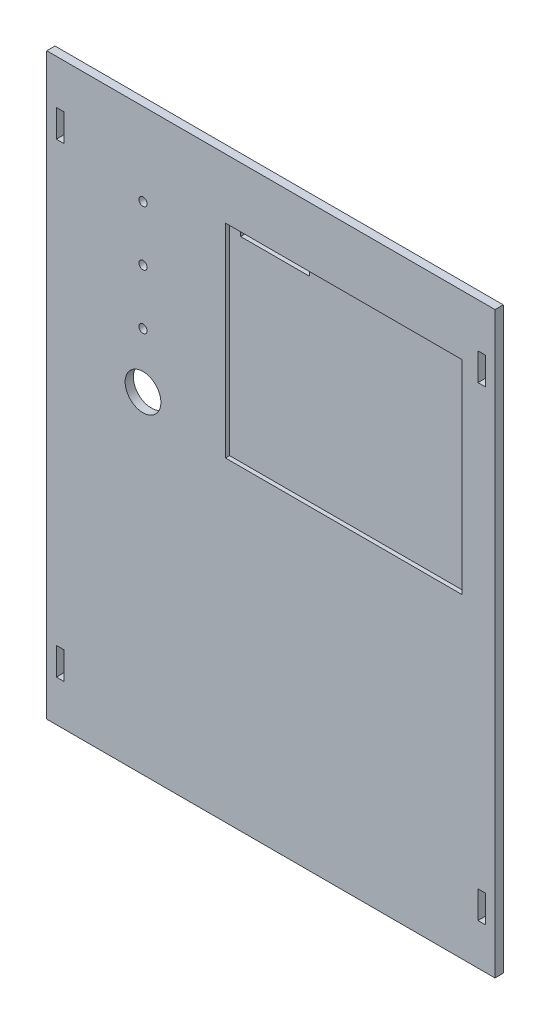
ISO-10303-21;
HEADER;
FILE_DESCRIPTION(('STEP AP214'),'2;1');
FILE_NAME('part.step','',(''),(''),'','','');
FILE_SCHEMA(('AUTOMOTIVE_DESIGN { 1 0 10303 214 1 1 1 1 }'));
ENDSEC;
DATA;
#1=APPLICATION_CONTEXT('core data for automotive mechanical design processes');
#2=APPLICATION_PROTOCOL_DEFINITION('international standard','automotive_design',2000,#1);
#3=PRODUCT_CONTEXT('',#1,'mechanical');
#4=PRODUCT('Part','Part','',(#3));
#5=PRODUCT_RELATED_PRODUCT_CATEGORY('part','',(#4));
#6=PRODUCT_DEFINITION_FORMATION('','',#4);
#7=PRODUCT_DEFINITION_CONTEXT('part definition',#1,'design');
#8=PRODUCT_DEFINITION('design','',#6,#7);
#9=PRODUCT_DEFINITION_SHAPE('','',#8);
#10=(LENGTH_UNIT() NAMED_UNIT(*) SI_UNIT(.MILLI.,.METRE.));
#11=(NAMED_UNIT(*) PLANE_ANGLE_UNIT() SI_UNIT($,.RADIAN.));
#12=(NAMED_UNIT(*) SI_UNIT($,.STERADIAN.) SOLID_ANGLE_UNIT());
#13=UNCERTAINTY_MEASURE_WITH_UNIT(LENGTH_MEASURE(1.E-05),#10,'distance_accuracy_value','');
#14=(GEOMETRIC_REPRESENTATION_CONTEXT(3) GLOBAL_UNCERTAINTY_ASSIGNED_CONTEXT((#13)) GLOBAL_UNIT_ASSIGNED_CONTEXT((#10,
#11,#12)) REPRESENTATION_CONTEXT('',''));
#15=CARTESIAN_POINT('',(0.,0.,0.));
#16=DIRECTION('',(0.,0.,1.));
#17=DIRECTION('',(1.,0.,0.));
#18=AXIS2_PLACEMENT_3D('',#15,#16,#17);
#19=CARTESIAN_POINT('',(0.,0.,1.5));
#20=DIRECTION('',(0.,0.,-1.));
#21=DIRECTION('',(-1.,0.,0.));
#22=AXIS2_PLACEMENT_3D('',#19,#20,#21);
#23=PLANE('',#22);
#24=DIRECTION('',(0.,-1.,0.));
#25=VECTOR('',#24,1.);
#26=CARTESIAN_POINT('',(-12.5,83.5,1.5));
#27=LINE('',#26,#25);
#28=CARTESIAN_POINT('',(-12.5,83.5,1.5));
#29=VERTEX_POINT('',#28);
#30=CARTESIAN_POINT('',(-12.5,80.5,1.5));
#31=VERTEX_POINT('',#30);
#32=EDGE_CURVE('E227',#29,#31,#27,.T.);
#33=ORIENTED_EDGE('',*,*,#32,.F.);
#34=DIRECTION('',(-1.,0.,0.));
#35=VECTOR('',#34,1.);
#36=CARTESIAN_POINT('',(69.5,83.5,1.5));
#37=LINE('',#36,#35);
#38=CARTESIAN_POINT('',(-16.5,83.5,1.5));
#39=VERTEX_POINT('',#38);
#40=EDGE_CURVE('E257',#29,#39,#37,.T.);
#41=ORIENTED_EDGE('',*,*,#40,.T.);
#42=DIRECTION('',(0.,-1.,0.));
#43=VECTOR('',#42,1.);
#44=CARTESIAN_POINT('',(-16.5,83.5,1.5));
#45=LINE('',#44,#43);
#46=CARTESIAN_POINT('',(-16.5,9.49999999999995,1.5));
#47=VERTEX_POINT('',#46);
#48=EDGE_CURVE('E262',#39,#47,#45,.T.);
#49=ORIENTED_EDGE('',*,*,#48,.T.);
#50=DIRECTION('',(1.,0.,0.));
#51=VECTOR('',#50,1.);
#52=CARTESIAN_POINT('',(69.5,9.49999999999997,1.5));
#53=LINE('',#52,#51);
#54=CARTESIAN_POINT('',(69.5,9.49999999999997,1.5));
#55=VERTEX_POINT('',#54);
#56=EDGE_CURVE('E265',#47,#55,#53,.T.);
#57=ORIENTED_EDGE('',*,*,#56,.T.);
#58=DIRECTION('',(0.,1.,0.));
#59=VECTOR('',#58,1.);
#60=CARTESIAN_POINT('',(69.5,83.5,1.5));
#61=LINE('',#60,#59);
#62=CARTESIAN_POINT('',(69.5,83.5,1.5));
#63=VERTEX_POINT('',#62);
#64=EDGE_CURVE('E254',#55,#63,#61,.T.);
#65=ORIENTED_EDGE('',*,*,#64,.T.);
#66=CARTESIAN_POINT('',(12.5,83.5,1.5));
#67=VERTEX_POINT('',#66);
#68=EDGE_CURVE('E259',#63,#67,#37,.T.);
#69=ORIENTED_EDGE('',*,*,#68,.T.);
#70=DIRECTION('',(0.,1.,0.));
#71=VECTOR('',#70,1.);
#72=CARTESIAN_POINT('',(12.5,83.5,1.5));
#73=LINE('',#72,#71);
#74=CARTESIAN_POINT('',(12.5,80.5,1.5));
#75=VERTEX_POINT('',#74);
#76=EDGE_CURVE('E229',#75,#67,#73,.T.);
#77=ORIENTED_EDGE('',*,*,#76,.F.);
#78=DIRECTION('',(1.,0.,0.));
#79=VECTOR('',#78,1.);
#80=CARTESIAN_POINT('',(-12.5,80.5,1.5));
#81=LINE('',#80,#79);
#82=EDGE_CURVE('E50',#31,#75,#81,.T.);
#83=ORIENTED_EDGE('',*,*,#82,.F.);
#84=EDGE_LOOP('',(#33,#41,#49,#57,#65,#69,#77,#83));
#85=FACE_BOUND('',#84,.T.);
#86=ADVANCED_FACE('F35',(#85),#23,.F.);
#87=CARTESIAN_POINT('',(0.,0.,3.));
#88=DIRECTION('',(0.,0.,1.));
#89=DIRECTION('',(1.,0.,0.));
#90=AXIS2_PLACEMENT_3D('',#87,#88,#89);
#91=PLANE('',#90);
#92=CARTESIAN_POINT('',(-46.5,55.25,3.));
#93=DIRECTION('',(0.,0.,1.));
#94=DIRECTION('',(1.,0.,0.));
#95=AXIS2_PLACEMENT_3D('',#92,#93,#94);
#96=CIRCLE('',#95,1.5);
#97=CARTESIAN_POINT('',(-45.,55.25,3.));
#98=VERTEX_POINT('',#97);
#99=EDGE_CURVE('E788',#98,#98,#96,.T.);
#100=ORIENTED_EDGE('',*,*,#99,.F.);
#101=EDGE_LOOP('',(#100));
#102=FACE_BOUND('',#101,.T.);
#103=CARTESIAN_POINT('',(-46.5,35.25,3.));
#104=DIRECTION('',(0.,0.,1.));
#105=DIRECTION('',(1.,0.,0.));
#106=AXIS2_PLACEMENT_3D('',#103,#104,#105);
#107=CIRCLE('',#106,1.5);
#108=CARTESIAN_POINT('',(-45.,35.25,3.));
#109=VERTEX_POINT('',#108);
#110=EDGE_CURVE('E800',#109,#109,#107,.T.);
#111=ORIENTED_EDGE('',*,*,#110,.F.);
#112=EDGE_LOOP('',(#111));
#113=FACE_BOUND('',#112,.T.);
#114=CARTESIAN_POINT('',(-46.5,15.25,3.));
#115=DIRECTION('',(0.,0.,1.));
#116=DIRECTION('',(1.,0.,0.));
#117=AXIS2_PLACEMENT_3D('',#114,#115,#116);
#118=CIRCLE('',#117,6.5);
#119=CARTESIAN_POINT('',(-40.,15.25,3.));
#120=VERTEX_POINT('',#119);
#121=EDGE_CURVE('E806',#120,#120,#118,.T.);
#122=ORIENTED_EDGE('',*,*,#121,.F.);
#123=EDGE_LOOP('',(#122));
#124=FACE_BOUND('',#123,.T.);
#125=CARTESIAN_POINT('',(-46.5,75.25,3.));
#126=DIRECTION('',(0.,0.,1.));
#127=DIRECTION('',(1.,0.,0.));
#128=AXIS2_PLACEMENT_3D('',#125,#126,#127);
#129=CIRCLE('',#128,1.5);
#130=CARTESIAN_POINT('',(-45.,75.25,3.));
#131=VERTEX_POINT('',#130);
#132=EDGE_CURVE('E792',#131,#131,#129,.T.);
#133=ORIENTED_EDGE('',*,*,#132,.F.);
#134=EDGE_LOOP('',(#133));
#135=FACE_BOUND('',#134,.T.);
#136=DIRECTION('',(0.,1.,0.));
#137=VECTOR('',#136,1.);
#138=CARTESIAN_POINT('',(69.5,83.5,3.));
#139=LINE('',#138,#137);
#140=CARTESIAN_POINT('',(69.5,9.49999999999997,3.));
#141=VERTEX_POINT('',#140);
#142=CARTESIAN_POINT('',(69.5,83.5,3.));
#143=VERTEX_POINT('',#142);
#144=EDGE_CURVE('E235',#141,#143,#139,.T.);
#145=ORIENTED_EDGE('',*,*,#144,.F.);
#146=DIRECTION('',(1.,0.,0.));
#147=VECTOR('',#146,1.);
#148=CARTESIAN_POINT('',(69.5,9.49999999999997,3.));
#149=LINE('',#148,#147);
#150=CARTESIAN_POINT('',(-16.5,9.49999999999995,3.));
#151=VERTEX_POINT('',#150);
#152=EDGE_CURVE('E258',#151,#141,#149,.T.);
#153=ORIENTED_EDGE('',*,*,#152,.F.);
#154=DIRECTION('',(0.,-1.,0.));
#155=VECTOR('',#154,1.);
#156=CARTESIAN_POINT('',(-16.5,83.5,3.));
#157=LINE('',#156,#155);
#158=CARTESIAN_POINT('',(-16.5,83.5,3.));
#159=VERTEX_POINT('',#158);
#160=EDGE_CURVE('E273',#159,#151,#157,.T.);
#161=ORIENTED_EDGE('',*,*,#160,.F.);
#162=DIRECTION('',(-1.,0.,0.));
#163=VECTOR('',#162,1.);
#164=CARTESIAN_POINT('',(69.5,83.5,3.));
#165=LINE('',#164,#163);
#166=EDGE_CURVE('E270',#143,#159,#165,.T.);
#167=ORIENTED_EDGE('',*,*,#166,.F.);
#168=EDGE_LOOP('',(#145,#153,#161,#167));
#169=FACE_BOUND('',#168,.T.);
#170=DIRECTION('',(-1.,0.,0.));
#171=VECTOR('',#170,1.);
#172=CARTESIAN_POINT('',(78.,89.15,3.));
#173=LINE('',#172,#171);
#174=CARTESIAN_POINT('',(78.,89.15,3.));
#175=VERTEX_POINT('',#174);
#176=CARTESIAN_POINT('',(75.3,89.15,3.));
#177=VERTEX_POINT('',#176);
#178=EDGE_CURVE('E295',#175,#177,#173,.T.);
#179=ORIENTED_EDGE('',*,*,#178,.F.);
#180=DIRECTION('',(0.,-1.,0.));
#181=VECTOR('',#180,1.);
#182=CARTESIAN_POINT('',(78.,89.15,3.));
#183=LINE('',#182,#181);
#184=CARTESIAN_POINT('',(78.,79.15,3.));
#185=VERTEX_POINT('',#184);
#186=EDGE_CURVE('E297',#175,#185,#183,.T.);
#187=ORIENTED_EDGE('',*,*,#186,.T.);
#188=DIRECTION('',(-1.,0.,0.));
#189=VECTOR('',#188,1.);
#190=CARTESIAN_POINT('',(78.,79.15,3.));
#191=LINE('',#190,#189);
#192=CARTESIAN_POINT('',(75.3,79.15,3.));
#193=VERTEX_POINT('',#192);
#194=EDGE_CURVE('E300',#185,#193,#191,.T.);
#195=ORIENTED_EDGE('',*,*,#194,.T.);
#196=DIRECTION('',(0.,-1.,0.));
#197=VECTOR('',#196,1.);
#198=CARTESIAN_POINT('',(75.3,89.15,3.));
#199=LINE('',#198,#197);
#200=EDGE_CURVE('E303',#177,#193,#199,.T.);
#201=ORIENTED_EDGE('',*,*,#200,.F.);
#202=EDGE_LOOP('',(#179,#187,#195,#201));
#203=FACE_BOUND('',#202,.T.);
#204=DIRECTION('',(-1.,0.,0.));
#205=VECTOR('',#204,1.);
#206=CARTESIAN_POINT('',(78.,-80.25,3.));
#207=LINE('',#206,#205);
#208=CARTESIAN_POINT('',(78.,-80.25,3.));
#209=VERTEX_POINT('',#208);
#210=CARTESIAN_POINT('',(75.3,-80.25,3.));
#211=VERTEX_POINT('',#210);
#212=EDGE_CURVE('E327',#209,#211,#207,.T.);
#213=ORIENTED_EDGE('',*,*,#212,.F.);
#214=DIRECTION('',(0.,-1.,0.));
#215=VECTOR('',#214,1.);
#216=CARTESIAN_POINT('',(78.,-80.25,3.));
#217=LINE('',#216,#215);
#218=CARTESIAN_POINT('',(78.,-90.25,3.));
#219=VERTEX_POINT('',#218);
#220=EDGE_CURVE('E329',#209,#219,#217,.T.);
#221=ORIENTED_EDGE('',*,*,#220,.T.);
#222=DIRECTION('',(-1.,0.,0.));
#223=VECTOR('',#222,1.);
#224=CARTESIAN_POINT('',(78.,-90.25,3.));
#225=LINE('',#224,#223);
#226=CARTESIAN_POINT('',(75.3,-90.25,3.));
#227=VERTEX_POINT('',#226);
#228=EDGE_CURVE('E332',#219,#227,#225,.T.);
#229=ORIENTED_EDGE('',*,*,#228,.T.);
#230=DIRECTION('',(0.,-1.,0.));
#231=VECTOR('',#230,1.);
#232=CARTESIAN_POINT('',(75.3,-80.25,3.));
#233=LINE('',#232,#231);
#234=EDGE_CURVE('E335',#211,#227,#233,.T.);
#235=ORIENTED_EDGE('',*,*,#234,.F.);
#236=EDGE_LOOP('',(#213,#221,#229,#235));
#237=FACE_BOUND('',#236,.T.);
#238=DIRECTION('',(0.,-1.,0.));
#239=VECTOR('',#238,1.);
#240=CARTESIAN_POINT('',(-81.5,105.25,3.));
#241=LINE('',#240,#239);
#242=CARTESIAN_POINT('',(-81.5,105.25,3.));
#243=VERTEX_POINT('',#242);
#244=CARTESIAN_POINT('',(-81.4999999999999,-105.25,3.));
#245=VERTEX_POINT('',#244);
#246=EDGE_CURVE('E415',#243,#245,#241,.T.);
#247=ORIENTED_EDGE('',*,*,#246,.T.);
#248=DIRECTION('',(1.,0.,0.));
#249=VECTOR('',#248,1.);
#250=CARTESIAN_POINT('',(-81.4999999999999,-105.25,3.));
#251=LINE('',#250,#249);
#252=CARTESIAN_POINT('',(81.5000000000001,-105.25,3.));
#253=VERTEX_POINT('',#252);
#254=EDGE_CURVE('E418',#245,#253,#251,.T.);
#255=ORIENTED_EDGE('',*,*,#254,.T.);
#256=DIRECTION('',(0.,-1.,0.));
#257=VECTOR('',#256,1.);
#258=CARTESIAN_POINT('',(81.5,105.25,3.));
#259=LINE('',#258,#257);
#260=CARTESIAN_POINT('',(81.5,105.25,3.));
#261=VERTEX_POINT('',#260);
#262=EDGE_CURVE('E421',#261,#253,#259,.T.);
#263=ORIENTED_EDGE('',*,*,#262,.F.);
#264=DIRECTION('',(1.,0.,0.));
#265=VECTOR('',#264,1.);
#266=CARTESIAN_POINT('',(-81.5,105.25,3.));
#267=LINE('',#266,#265);
#268=EDGE_CURVE('E424',#243,#261,#267,.T.);
#269=ORIENTED_EDGE('',*,*,#268,.F.);
#270=EDGE_LOOP('',(#247,#255,#263,#269));
#271=FACE_BOUND('',#270,.T.);
#272=DIRECTION('',(0.,-1.,0.));
#273=VECTOR('',#272,1.);
#274=CARTESIAN_POINT('',(-78.,-80.25,3.));
#275=LINE('',#274,#273);
#276=CARTESIAN_POINT('',(-78.,-80.25,3.));
#277=VERTEX_POINT('',#276);
#278=CARTESIAN_POINT('',(-78.,-90.25,3.));
#279=VERTEX_POINT('',#278);
#280=EDGE_CURVE('E399',#277,#279,#275,.T.);
#281=ORIENTED_EDGE('',*,*,#280,.F.);
#282=DIRECTION('',(1.,0.,0.));
#283=VECTOR('',#282,1.);
#284=CARTESIAN_POINT('',(-78.,-80.25,3.));
#285=LINE('',#284,#283);
#286=CARTESIAN_POINT('',(-75.3,-80.25,3.));
#287=VERTEX_POINT('',#286);
#288=EDGE_CURVE('E390',#277,#287,#285,.T.);
#289=ORIENTED_EDGE('',*,*,#288,.T.);
#290=DIRECTION('',(0.,-1.,0.));
#291=VECTOR('',#290,1.);
#292=CARTESIAN_POINT('',(-75.3,-80.25,3.));
#293=LINE('',#292,#291);
#294=CARTESIAN_POINT('',(-75.3,-90.25,3.));
#295=VERTEX_POINT('',#294);
#296=EDGE_CURVE('E393',#287,#295,#293,.T.);
#297=ORIENTED_EDGE('',*,*,#296,.T.);
#298=DIRECTION('',(1.,0.,0.));
#299=VECTOR('',#298,1.);
#300=CARTESIAN_POINT('',(-78.,-90.25,3.));
#301=LINE('',#300,#299);
#302=EDGE_CURVE('E396',#279,#295,#301,.T.);
#303=ORIENTED_EDGE('',*,*,#302,.F.);
#304=EDGE_LOOP('',(#281,#289,#297,#303));
#305=FACE_BOUND('',#304,.T.);
#306=DIRECTION('',(0.,-1.,0.));
#307=VECTOR('',#306,1.);
#308=CARTESIAN_POINT('',(-78.,89.15,3.));
#309=LINE('',#308,#307);
#310=CARTESIAN_POINT('',(-78.,89.15,3.));
#311=VERTEX_POINT('',#310);
#312=CARTESIAN_POINT('',(-78.,79.15,3.));
#313=VERTEX_POINT('',#312);
#314=EDGE_CURVE('E362',#311,#313,#309,.T.);
#315=ORIENTED_EDGE('',*,*,#314,.F.);
#316=DIRECTION('',(1.,0.,0.));
#317=VECTOR('',#316,1.);
#318=CARTESIAN_POINT('',(-78.,89.15,3.));
#319=LINE('',#318,#317);
#320=CARTESIAN_POINT('',(-75.3,89.15,3.));
#321=VERTEX_POINT('',#320);
#322=EDGE_CURVE('E371',#311,#321,#319,.T.);
#323=ORIENTED_EDGE('',*,*,#322,.T.);
#324=DIRECTION('',(0.,-1.,0.));
#325=VECTOR('',#324,1.);
#326=CARTESIAN_POINT('',(-75.3,89.15,3.));
#327=LINE('',#326,#325);
#328=CARTESIAN_POINT('',(-75.3,79.15,3.));
#329=VERTEX_POINT('',#328);
#330=EDGE_CURVE('E368',#321,#329,#327,.T.);
#331=ORIENTED_EDGE('',*,*,#330,.T.);
#332=DIRECTION('',(1.,0.,0.));
#333=VECTOR('',#332,1.);
#334=CARTESIAN_POINT('',(-78.,79.15,3.));
#335=LINE('',#334,#333);
#336=EDGE_CURVE('E365',#313,#329,#335,.T.);
#337=ORIENTED_EDGE('',*,*,#336,.F.);
#338=EDGE_LOOP('',(#315,#323,#331,#337));
#339=FACE_BOUND('',#338,.T.);
#340=ADVANCED_FACE('F457',(#102,#113,#124,#135,#169,#203,#237,#271,#305,#339),#91,.T.);
#341=CARTESIAN_POINT('',(0.,0.,0.));
#342=DIRECTION('',(0.,0.,1.));
#343=DIRECTION('',(1.,0.,0.));
#344=AXIS2_PLACEMENT_3D('',#341,#342,#343);
#345=PLANE('',#344);
#346=CARTESIAN_POINT('',(-46.5,55.25,0.));
#347=DIRECTION('',(0.,0.,1.));
#348=DIRECTION('',(1.,0.,0.));
#349=AXIS2_PLACEMENT_3D('',#346,#347,#348);
#350=CIRCLE('',#349,1.5);
#351=CARTESIAN_POINT('',(-45.,55.25,0.));
#352=VERTEX_POINT('',#351);
#353=EDGE_CURVE('E791',#352,#352,#350,.F.);
#354=ORIENTED_EDGE('',*,*,#353,.F.);
#355=EDGE_LOOP('',(#354));
#356=FACE_BOUND('',#355,.T.);
#357=CARTESIAN_POINT('',(-46.5,35.25,0.));
#358=DIRECTION('',(0.,0.,1.));
#359=DIRECTION('',(1.,0.,0.));
#360=AXIS2_PLACEMENT_3D('',#357,#358,#359);
#361=CIRCLE('',#360,1.5);
#362=CARTESIAN_POINT('',(-45.,35.25,0.));
#363=VERTEX_POINT('',#362);
#364=EDGE_CURVE('E797',#363,#363,#361,.F.);
#365=ORIENTED_EDGE('',*,*,#364,.F.);
#366=EDGE_LOOP('',(#365));
#367=FACE_BOUND('',#366,.T.);
#368=CARTESIAN_POINT('',(-46.5,15.25,0.));
#369=DIRECTION('',(0.,0.,1.));
#370=DIRECTION('',(1.,0.,0.));
#371=AXIS2_PLACEMENT_3D('',#368,#369,#370);
#372=CIRCLE('',#371,6.5);
#373=CARTESIAN_POINT('',(-40.,15.25,0.));
#374=VERTEX_POINT('',#373);
#375=EDGE_CURVE('E803',#374,#374,#372,.F.);
#376=ORIENTED_EDGE('',*,*,#375,.F.);
#377=EDGE_LOOP('',(#376));
#378=FACE_BOUND('',#377,.T.);
#379=CARTESIAN_POINT('',(-46.5,75.25,0.));
#380=DIRECTION('',(0.,0.,1.));
#381=DIRECTION('',(1.,0.,0.));
#382=AXIS2_PLACEMENT_3D('',#379,#380,#381);
#383=CIRCLE('',#382,1.5);
#384=CARTESIAN_POINT('',(-45.,75.25,0.));
#385=VERTEX_POINT('',#384);
#386=EDGE_CURVE('E795',#385,#385,#383,.F.);
#387=ORIENTED_EDGE('',*,*,#386,.F.);
#388=EDGE_LOOP('',(#387));
#389=FACE_BOUND('',#388,.T.);
#390=DIRECTION('',(1.,0.,0.));
#391=VECTOR('',#390,1.);
#392=CARTESIAN_POINT('',(-12.5,83.5,0.));
#393=LINE('',#392,#391);
#394=CARTESIAN_POINT('',(-12.5,83.5,0.));
#395=VERTEX_POINT('',#394);
#396=CARTESIAN_POINT('',(12.5,83.5,0.));
#397=VERTEX_POINT('',#396);
#398=EDGE_CURVE('E241',#395,#397,#393,.T.);
#399=ORIENTED_EDGE('',*,*,#398,.F.);
#400=DIRECTION('',(0.,1.,0.));
#401=VECTOR('',#400,1.);
#402=CARTESIAN_POINT('',(-12.5,83.5,0.));
#403=LINE('',#402,#401);
#404=CARTESIAN_POINT('',(-12.5,80.5,0.));
#405=VERTEX_POINT('',#404);
#406=EDGE_CURVE('E224',#405,#395,#403,.T.);
#407=ORIENTED_EDGE('',*,*,#406,.F.);
#408=DIRECTION('',(-1.,0.,0.));
#409=VECTOR('',#408,1.);
#410=CARTESIAN_POINT('',(-12.5,80.5,0.));
#411=LINE('',#410,#409);
#412=CARTESIAN_POINT('',(12.5,80.5,0.));
#413=VERTEX_POINT('',#412);
#414=EDGE_CURVE('E232',#413,#405,#411,.T.);
#415=ORIENTED_EDGE('',*,*,#414,.F.);
#416=DIRECTION('',(0.,-1.,0.));
#417=VECTOR('',#416,1.);
#418=CARTESIAN_POINT('',(12.5,83.5,0.));
#419=LINE('',#418,#417);
#420=EDGE_CURVE('E57',#397,#413,#419,.T.);
#421=ORIENTED_EDGE('',*,*,#420,.F.);
#422=EDGE_LOOP('',(#399,#407,#415,#421));
#423=FACE_BOUND('',#422,.T.);
#424=DIRECTION('',(0.,1.,0.));
#425=VECTOR('',#424,1.);
#426=CARTESIAN_POINT('',(78.,89.15,0.));
#427=LINE('',#426,#425);
#428=CARTESIAN_POINT('',(78.,79.15,0.));
#429=VERTEX_POINT('',#428);
#430=CARTESIAN_POINT('',(78.,89.15,0.));
#431=VERTEX_POINT('',#430);
#432=EDGE_CURVE('E289',#429,#431,#427,.T.);
#433=ORIENTED_EDGE('',*,*,#432,.T.);
#434=DIRECTION('',(1.,0.,0.));
#435=VECTOR('',#434,1.);
#436=CARTESIAN_POINT('',(78.,89.15,0.));
#437=LINE('',#436,#435);
#438=CARTESIAN_POINT('',(75.3,89.15,0.));
#439=VERTEX_POINT('',#438);
#440=EDGE_CURVE('E292',#439,#431,#437,.T.);
#441=ORIENTED_EDGE('',*,*,#440,.F.);
#442=DIRECTION('',(0.,1.,0.));
#443=VECTOR('',#442,1.);
#444=CARTESIAN_POINT('',(75.3,89.15,0.));
#445=LINE('',#444,#443);
#446=CARTESIAN_POINT('',(75.3,79.15,0.));
#447=VERTEX_POINT('',#446);
#448=EDGE_CURVE('E315',#447,#439,#445,.T.);
#449=ORIENTED_EDGE('',*,*,#448,.F.);
#450=DIRECTION('',(1.,0.,0.));
#451=VECTOR('',#450,1.);
#452=CARTESIAN_POINT('',(78.,79.15,0.));
#453=LINE('',#452,#451);
#454=EDGE_CURVE('E280',#447,#429,#453,.T.);
#455=ORIENTED_EDGE('',*,*,#454,.T.);
#456=EDGE_LOOP('',(#433,#441,#449,#455));
#457=FACE_BOUND('',#456,.T.);
#458=DIRECTION('',(0.,1.,0.));
#459=VECTOR('',#458,1.);
#460=CARTESIAN_POINT('',(78.,-80.25,0.));
#461=LINE('',#460,#459);
#462=CARTESIAN_POINT('',(78.,-90.25,0.));
#463=VERTEX_POINT('',#462);
#464=CARTESIAN_POINT('',(78.,-80.25,0.));
#465=VERTEX_POINT('',#464);
#466=EDGE_CURVE('E321',#463,#465,#461,.T.);
#467=ORIENTED_EDGE('',*,*,#466,.T.);
#468=DIRECTION('',(1.,0.,0.));
#469=VECTOR('',#468,1.);
#470=CARTESIAN_POINT('',(78.,-80.25,0.));
#471=LINE('',#470,#469);
#472=CARTESIAN_POINT('',(75.3,-80.25,0.));
#473=VERTEX_POINT('',#472);
#474=EDGE_CURVE('E324',#473,#465,#471,.T.);
#475=ORIENTED_EDGE('',*,*,#474,.F.);
#476=DIRECTION('',(0.,1.,0.));
#477=VECTOR('',#476,1.);
#478=CARTESIAN_POINT('',(75.3,-80.25,0.));
#479=LINE('',#478,#477);
#480=CARTESIAN_POINT('',(75.3,-90.25,0.));
#481=VERTEX_POINT('',#480);
#482=EDGE_CURVE('E347',#481,#473,#479,.T.);
#483=ORIENTED_EDGE('',*,*,#482,.F.);
#484=DIRECTION('',(1.,0.,0.));
#485=VECTOR('',#484,1.);
#486=CARTESIAN_POINT('',(78.,-90.25,0.));
#487=LINE('',#486,#485);
#488=EDGE_CURVE('E318',#481,#463,#487,.T.);
#489=ORIENTED_EDGE('',*,*,#488,.T.);
#490=EDGE_LOOP('',(#467,#475,#483,#489));
#491=FACE_BOUND('',#490,.T.);
#492=DIRECTION('',(-1.,0.,0.));
#493=VECTOR('',#492,1.);
#494=CARTESIAN_POINT('',(-78.,-80.25,0.));
#495=LINE('',#494,#493);
#496=CARTESIAN_POINT('',(-75.3,-80.25,0.));
#497=VERTEX_POINT('',#496);
#498=CARTESIAN_POINT('',(-78.,-80.25,0.));
#499=VERTEX_POINT('',#498);
#500=EDGE_CURVE('E387',#497,#499,#495,.T.);
#501=ORIENTED_EDGE('',*,*,#500,.T.);
#502=DIRECTION('',(0.,1.,0.));
#503=VECTOR('',#502,1.);
#504=CARTESIAN_POINT('',(-78.,-80.25,0.));
#505=LINE('',#504,#503);
#506=CARTESIAN_POINT('',(-78.,-90.25,0.));
#507=VERTEX_POINT('',#506);
#508=EDGE_CURVE('E411',#507,#499,#505,.T.);
#509=ORIENTED_EDGE('',*,*,#508,.F.);
#510=DIRECTION('',(-1.,0.,0.));
#511=VECTOR('',#510,1.);
#512=CARTESIAN_POINT('',(-78.,-90.25,0.));
#513=LINE('',#512,#511);
#514=CARTESIAN_POINT('',(-75.3,-90.25,0.));
#515=VERTEX_POINT('',#514);
#516=EDGE_CURVE('E382',#515,#507,#513,.T.);
#517=ORIENTED_EDGE('',*,*,#516,.F.);
#518=DIRECTION('',(0.,1.,0.));
#519=VECTOR('',#518,1.);
#520=CARTESIAN_POINT('',(-75.3,-80.25,0.));
#521=LINE('',#520,#519);
#522=EDGE_CURVE('E384',#515,#497,#521,.T.);
#523=ORIENTED_EDGE('',*,*,#522,.T.);
#524=EDGE_LOOP('',(#501,#509,#517,#523));
#525=FACE_BOUND('',#524,.T.);
#526=DIRECTION('',(0.,-1.,0.));
#527=VECTOR('',#526,1.);
#528=CARTESIAN_POINT('',(-81.5,105.25,0.));
#529=LINE('',#528,#527);
#530=CARTESIAN_POINT('',(-81.5,105.25,0.));
#531=VERTEX_POINT('',#530);
#532=CARTESIAN_POINT('',(-81.4999999999999,-105.25,0.));
#533=VERTEX_POINT('',#532);
#534=EDGE_CURVE('E414',#531,#533,#529,.T.);
#535=ORIENTED_EDGE('',*,*,#534,.F.);
#536=DIRECTION('',(1.,0.,0.));
#537=VECTOR('',#536,1.);
#538=CARTESIAN_POINT('',(-81.5,105.25,0.));
#539=LINE('',#538,#537);
#540=CARTESIAN_POINT('',(81.5,105.25,0.));
#541=VERTEX_POINT('',#540);
#542=EDGE_CURVE('E419',#531,#541,#539,.T.);
#543=ORIENTED_EDGE('',*,*,#542,.T.);
#544=DIRECTION('',(0.,-1.,0.));
#545=VECTOR('',#544,1.);
#546=CARTESIAN_POINT('',(81.5,105.25,0.));
#547=LINE('',#546,#545);
#548=CARTESIAN_POINT('',(81.5000000000001,-105.25,0.));
#549=VERTEX_POINT('',#548);
#550=EDGE_CURVE('E433',#541,#549,#547,.T.);
#551=ORIENTED_EDGE('',*,*,#550,.T.);
#552=DIRECTION('',(1.,0.,0.));
#553=VECTOR('',#552,1.);
#554=CARTESIAN_POINT('',(-81.4999999999999,-105.25,0.));
#555=LINE('',#554,#553);
#556=EDGE_CURVE('E430',#533,#549,#555,.T.);
#557=ORIENTED_EDGE('',*,*,#556,.F.);
#558=EDGE_LOOP('',(#535,#543,#551,#557));
#559=FACE_BOUND('',#558,.T.);
#560=DIRECTION('',(-1.,0.,0.));
#561=VECTOR('',#560,1.);
#562=CARTESIAN_POINT('',(-78.,89.15,0.));
#563=LINE('',#562,#561);
#564=CARTESIAN_POINT('',(-75.3,89.15,0.));
#565=VERTEX_POINT('',#564);
#566=CARTESIAN_POINT('',(-78.,89.15,0.));
#567=VERTEX_POINT('',#566);
#568=EDGE_CURVE('E374',#565,#567,#563,.T.);
#569=ORIENTED_EDGE('',*,*,#568,.T.);
#570=DIRECTION('',(0.,1.,0.));
#571=VECTOR('',#570,1.);
#572=CARTESIAN_POINT('',(-78.,89.15,0.));
#573=LINE('',#572,#571);
#574=CARTESIAN_POINT('',(-78.,79.15,0.));
#575=VERTEX_POINT('',#574);
#576=EDGE_CURVE('E350',#575,#567,#573,.T.);
#577=ORIENTED_EDGE('',*,*,#576,.F.);
#578=DIRECTION('',(-1.,0.,0.));
#579=VECTOR('',#578,1.);
#580=CARTESIAN_POINT('',(-78.,79.15,0.));
#581=LINE('',#580,#579);
#582=CARTESIAN_POINT('',(-75.3,79.15,0.));
#583=VERTEX_POINT('',#582);
#584=EDGE_CURVE('E380',#583,#575,#581,.T.);
#585=ORIENTED_EDGE('',*,*,#584,.F.);
#586=DIRECTION('',(0.,1.,0.));
#587=VECTOR('',#586,1.);
#588=CARTESIAN_POINT('',(-75.3,89.15,0.));
#589=LINE('',#588,#587);
#590=EDGE_CURVE('E377',#583,#565,#589,.T.);
#591=ORIENTED_EDGE('',*,*,#590,.T.);
#592=EDGE_LOOP('',(#569,#577,#585,#591));
#593=FACE_BOUND('',#592,.T.);
#594=ADVANCED_FACE('F238',(#356,#367,#378,#389,#423,#457,#491,#525,#559,#593),#345,.F.);
#595=CARTESIAN_POINT('',(-81.5,105.25,3.));
#596=DIRECTION('',(1.,0.,0.));
#597=DIRECTION('',(0.,1.,0.));
#598=AXIS2_PLACEMENT_3D('',#595,#596,#597);
#599=PLANE('',#598);
#600=ORIENTED_EDGE('',*,*,#534,.T.);
#601=DIRECTION('',(0.,0.,-1.));
#602=VECTOR('',#601,1.);
#603=CARTESIAN_POINT('',(-81.4999999999999,-105.25,3.));
#604=LINE('',#603,#602);
#605=EDGE_CURVE('E11',#245,#533,#604,.T.);
#606=ORIENTED_EDGE('',*,*,#605,.F.);
#607=ORIENTED_EDGE('',*,*,#246,.F.);
#608=DIRECTION('',(0.,0.,-1.));
#609=VECTOR('',#608,1.);
#610=CARTESIAN_POINT('',(-81.5,105.25,3.));
#611=LINE('',#610,#609);
#612=EDGE_CURVE('E427',#243,#531,#611,.T.);
#613=ORIENTED_EDGE('',*,*,#612,.T.);
#614=EDGE_LOOP('',(#600,#606,#607,#613));
#615=FACE_BOUND('',#614,.T.);
#616=ADVANCED_FACE('F37',(#615),#599,.F.);
#617=CARTESIAN_POINT('',(-81.4999999999999,-105.25,3.));
#618=DIRECTION('',(0.,1.,0.));
#619=DIRECTION('',(0.,0.,1.));
#620=AXIS2_PLACEMENT_3D('',#617,#618,#619);
#621=PLANE('',#620);
#622=ORIENTED_EDGE('',*,*,#556,.T.);
#623=DIRECTION('',(0.,0.,-1.));
#624=VECTOR('',#623,1.);
#625=CARTESIAN_POINT('',(81.5000000000001,-105.25,3.));
#626=LINE('',#625,#624);
#627=EDGE_CURVE('E43',#253,#549,#626,.T.);
#628=ORIENTED_EDGE('',*,*,#627,.F.);
#629=ORIENTED_EDGE('',*,*,#254,.F.);
#630=ORIENTED_EDGE('',*,*,#605,.T.);
#631=EDGE_LOOP('',(#622,#628,#629,#630));
#632=FACE_BOUND('',#631,.T.);
#633=ADVANCED_FACE('F446',(#632),#621,.F.);
#634=CARTESIAN_POINT('',(81.5,105.25,3.));
#635=DIRECTION('',(1.,0.,0.));
#636=DIRECTION('',(0.,1.,0.));
#637=AXIS2_PLACEMENT_3D('',#634,#635,#636);
#638=PLANE('',#637);
#639=ORIENTED_EDGE('',*,*,#550,.F.);
#640=DIRECTION('',(0.,0.,-1.));
#641=VECTOR('',#640,1.);
#642=CARTESIAN_POINT('',(81.5,105.25,3.));
#643=LINE('',#642,#641);
#644=EDGE_CURVE('E439',#261,#541,#643,.T.);
#645=ORIENTED_EDGE('',*,*,#644,.F.);
#646=ORIENTED_EDGE('',*,*,#262,.T.);
#647=ORIENTED_EDGE('',*,*,#627,.T.);
#648=EDGE_LOOP('',(#639,#645,#646,#647));
#649=FACE_BOUND('',#648,.T.);
#650=ADVANCED_FACE('F443',(#649),#638,.T.);
#651=CARTESIAN_POINT('',(-81.5,105.25,3.));
#652=DIRECTION('',(0.,1.,0.));
#653=DIRECTION('',(-1.,0.,0.));
#654=AXIS2_PLACEMENT_3D('',#651,#652,#653);
#655=PLANE('',#654);
#656=ORIENTED_EDGE('',*,*,#542,.F.);
#657=ORIENTED_EDGE('',*,*,#612,.F.);
#658=ORIENTED_EDGE('',*,*,#268,.T.);
#659=ORIENTED_EDGE('',*,*,#644,.T.);
#660=EDGE_LOOP('',(#656,#657,#658,#659));
#661=FACE_BOUND('',#660,.T.);
#662=ADVANCED_FACE('F453',(#661),#655,.T.);
#663=CARTESIAN_POINT('',(-78.,-80.25,-0.00100000000000013));
#664=DIRECTION('',(0.,-1.,0.));
#665=DIRECTION('',(0.,0.,-1.));
#666=AXIS2_PLACEMENT_3D('',#663,#664,#665);
#667=PLANE('',#666);
#668=DIRECTION('',(0.,0.,1.));
#669=VECTOR('',#668,1.);
#670=CARTESIAN_POINT('',(-75.3,-80.25,-0.00100000000000013));
#671=LINE('',#670,#669);
#672=EDGE_CURVE('E409',#497,#287,#671,.T.);
#673=ORIENTED_EDGE('',*,*,#672,.T.);
#674=ORIENTED_EDGE('',*,*,#288,.F.);
#675=DIRECTION('',(0.,0.,1.));
#676=VECTOR('',#675,1.);
#677=CARTESIAN_POINT('',(-78.,-80.25,-0.00100000000000013));
#678=LINE('',#677,#676);
#679=EDGE_CURVE('E402',#499,#277,#678,.T.);
#680=ORIENTED_EDGE('',*,*,#679,.F.);
#681=ORIENTED_EDGE('',*,*,#500,.F.);
#682=EDGE_LOOP('',(#673,#674,#680,#681));
#683=FACE_BOUND('',#682,.T.);
#684=ADVANCED_FACE('F553',(#683),#667,.T.);
#685=CARTESIAN_POINT('',(-75.3,-80.25,-0.00100000000000013));
#686=DIRECTION('',(-1.,0.,0.));
#687=DIRECTION('',(0.,-1.,0.));
#688=AXIS2_PLACEMENT_3D('',#685,#686,#687);
#689=PLANE('',#688);
#690=DIRECTION('',(0.,0.,1.));
#691=VECTOR('',#690,1.);
#692=CARTESIAN_POINT('',(-75.3,-90.25,-0.00100000000000013));
#693=LINE('',#692,#691);
#694=EDGE_CURVE('E407',#515,#295,#693,.T.);
#695=ORIENTED_EDGE('',*,*,#694,.T.);
#696=ORIENTED_EDGE('',*,*,#296,.F.);
#697=ORIENTED_EDGE('',*,*,#672,.F.);
#698=ORIENTED_EDGE('',*,*,#522,.F.);
#699=EDGE_LOOP('',(#695,#696,#697,#698));
#700=FACE_BOUND('',#699,.T.);
#701=ADVANCED_FACE('F549',(#700),#689,.T.);
#702=CARTESIAN_POINT('',(-78.,-90.25,-0.00100000000000013));
#703=DIRECTION('',(0.,-1.,0.));
#704=DIRECTION('',(0.,0.,-1.));
#705=AXIS2_PLACEMENT_3D('',#702,#703,#704);
#706=PLANE('',#705);
#707=ORIENTED_EDGE('',*,*,#516,.T.);
#708=DIRECTION('',(0.,0.,1.));
#709=VECTOR('',#708,1.);
#710=CARTESIAN_POINT('',(-78.,-90.25,-0.00100000000000013));
#711=LINE('',#710,#709);
#712=EDGE_CURVE('E405',#507,#279,#711,.T.);
#713=ORIENTED_EDGE('',*,*,#712,.T.);
#714=ORIENTED_EDGE('',*,*,#302,.T.);
#715=ORIENTED_EDGE('',*,*,#694,.F.);
#716=EDGE_LOOP('',(#707,#713,#714,#715));
#717=FACE_BOUND('',#716,.T.);
#718=ADVANCED_FACE('F545',(#717),#706,.F.);
#719=CARTESIAN_POINT('',(-78.,-80.25,-0.00100000000000013));
#720=DIRECTION('',(-1.,0.,0.));
#721=DIRECTION('',(0.,-1.,0.));
#722=AXIS2_PLACEMENT_3D('',#719,#720,#721);
#723=PLANE('',#722);
#724=ORIENTED_EDGE('',*,*,#508,.T.);
#725=ORIENTED_EDGE('',*,*,#679,.T.);
#726=ORIENTED_EDGE('',*,*,#280,.T.);
#727=ORIENTED_EDGE('',*,*,#712,.F.);
#728=EDGE_LOOP('',(#724,#725,#726,#727));
#729=FACE_BOUND('',#728,.T.);
#730=ADVANCED_FACE('F531',(#729),#723,.F.);
#731=CARTESIAN_POINT('',(-78.,89.15,-0.00100000000000013));
#732=DIRECTION('',(0.,-1.,0.));
#733=DIRECTION('',(0.,0.,-1.));
#734=AXIS2_PLACEMENT_3D('',#731,#732,#733);
#735=PLANE('',#734);
#736=DIRECTION('',(0.,0.,1.));
#737=VECTOR('',#736,1.);
#738=CARTESIAN_POINT('',(-75.3,89.15,-0.00100000000000013));
#739=LINE('',#738,#737);
#740=EDGE_CURVE('E353',#565,#321,#739,.T.);
#741=ORIENTED_EDGE('',*,*,#740,.T.);
#742=ORIENTED_EDGE('',*,*,#322,.F.);
#743=DIRECTION('',(0.,0.,1.));
#744=VECTOR('',#743,1.);
#745=CARTESIAN_POINT('',(-78.,89.15,-0.00100000000000013));
#746=LINE('',#745,#744);
#747=EDGE_CURVE('E359',#567,#311,#746,.T.);
#748=ORIENTED_EDGE('',*,*,#747,.F.);
#749=ORIENTED_EDGE('',*,*,#568,.F.);
#750=EDGE_LOOP('',(#741,#742,#748,#749));
#751=FACE_BOUND('',#750,.T.);
#752=ADVANCED_FACE('F527',(#751),#735,.T.);
#753=CARTESIAN_POINT('',(-75.3,89.15,-0.00100000000000013));
#754=DIRECTION('',(-1.,0.,0.));
#755=DIRECTION('',(0.,0.,1.));
#756=AXIS2_PLACEMENT_3D('',#753,#754,#755);
#757=PLANE('',#756);
#758=DIRECTION('',(0.,0.,1.));
#759=VECTOR('',#758,1.);
#760=CARTESIAN_POINT('',(-75.3,79.15,-0.00100000000000013));
#761=LINE('',#760,#759);
#762=EDGE_CURVE('E355',#583,#329,#761,.T.);
#763=ORIENTED_EDGE('',*,*,#762,.T.);
#764=ORIENTED_EDGE('',*,*,#330,.F.);
#765=ORIENTED_EDGE('',*,*,#740,.F.);
#766=ORIENTED_EDGE('',*,*,#590,.F.);
#767=EDGE_LOOP('',(#763,#764,#765,#766));
#768=FACE_BOUND('',#767,.T.);
#769=ADVANCED_FACE('F530',(#768),#757,.T.);
#770=CARTESIAN_POINT('',(-78.,79.15,-0.00100000000000013));
#771=DIRECTION('',(0.,-1.,0.));
#772=DIRECTION('',(1.,0.,0.));
#773=AXIS2_PLACEMENT_3D('',#770,#771,#772);
#774=PLANE('',#773);
#775=ORIENTED_EDGE('',*,*,#584,.T.);
#776=DIRECTION('',(0.,0.,1.));
#777=VECTOR('',#776,1.);
#778=CARTESIAN_POINT('',(-78.,79.15,-0.00100000000000013));
#779=LINE('',#778,#777);
#780=EDGE_CURVE('E357',#575,#313,#779,.T.);
#781=ORIENTED_EDGE('',*,*,#780,.T.);
#782=ORIENTED_EDGE('',*,*,#336,.T.);
#783=ORIENTED_EDGE('',*,*,#762,.F.);
#784=EDGE_LOOP('',(#775,#781,#782,#783));
#785=FACE_BOUND('',#784,.T.);
#786=ADVANCED_FACE('F535',(#785),#774,.F.);
#787=CARTESIAN_POINT('',(-78.,89.15,-0.00100000000000013));
#788=DIRECTION('',(-1.,0.,0.));
#789=DIRECTION('',(0.,-1.,0.));
#790=AXIS2_PLACEMENT_3D('',#787,#788,#789);
#791=PLANE('',#790);
#792=ORIENTED_EDGE('',*,*,#576,.T.);
#793=ORIENTED_EDGE('',*,*,#747,.T.);
#794=ORIENTED_EDGE('',*,*,#314,.T.);
#795=ORIENTED_EDGE('',*,*,#780,.F.);
#796=EDGE_LOOP('',(#792,#793,#794,#795));
#797=FACE_BOUND('',#796,.T.);
#798=ADVANCED_FACE('F525',(#797),#791,.F.);
#799=CARTESIAN_POINT('',(78.,-80.25,-0.00100000000000013));
#800=DIRECTION('',(0.,1.,0.));
#801=DIRECTION('',(0.,0.,1.));
#802=AXIS2_PLACEMENT_3D('',#799,#800,#801);
#803=PLANE('',#802);
#804=ORIENTED_EDGE('',*,*,#474,.T.);
#805=DIRECTION('',(0.,0.,1.));
#806=VECTOR('',#805,1.);
#807=CARTESIAN_POINT('',(78.,-80.25,-0.00100000000000013));
#808=LINE('',#807,#806);
#809=EDGE_CURVE('E345',#465,#209,#808,.T.);
#810=ORIENTED_EDGE('',*,*,#809,.T.);
#811=ORIENTED_EDGE('',*,*,#212,.T.);
#812=DIRECTION('',(0.,0.,1.));
#813=VECTOR('',#812,1.);
#814=CARTESIAN_POINT('',(75.3,-80.25,-0.00100000000000013));
#815=LINE('',#814,#813);
#816=EDGE_CURVE('E338',#473,#211,#815,.T.);
#817=ORIENTED_EDGE('',*,*,#816,.F.);
#818=EDGE_LOOP('',(#804,#810,#811,#817));
#819=FACE_BOUND('',#818,.T.);
#820=ADVANCED_FACE('F521',(#819),#803,.F.);
#821=CARTESIAN_POINT('',(78.,-80.25,-0.00100000000000013));
#822=DIRECTION('',(-1.,0.,0.));
#823=DIRECTION('',(0.,-1.,0.));
#824=AXIS2_PLACEMENT_3D('',#821,#822,#823);
#825=PLANE('',#824);
#826=DIRECTION('',(0.,0.,1.));
#827=VECTOR('',#826,1.);
#828=CARTESIAN_POINT('',(78.,-90.25,-0.00100000000000013));
#829=LINE('',#828,#827);
#830=EDGE_CURVE('E343',#463,#219,#829,.T.);
#831=ORIENTED_EDGE('',*,*,#830,.T.);
#832=ORIENTED_EDGE('',*,*,#220,.F.);
#833=ORIENTED_EDGE('',*,*,#809,.F.);
#834=ORIENTED_EDGE('',*,*,#466,.F.);
#835=EDGE_LOOP('',(#831,#832,#833,#834));
#836=FACE_BOUND('',#835,.T.);
#837=ADVANCED_FACE('F517',(#836),#825,.T.);
#838=CARTESIAN_POINT('',(78.,-90.25,-0.00100000000000013));
#839=DIRECTION('',(0.,1.,0.));
#840=DIRECTION('',(0.,0.,1.));
#841=AXIS2_PLACEMENT_3D('',#838,#839,#840);
#842=PLANE('',#841);
#843=DIRECTION('',(0.,0.,1.));
#844=VECTOR('',#843,1.);
#845=CARTESIAN_POINT('',(75.3,-90.25,-0.00100000000000013));
#846=LINE('',#845,#844);
#847=EDGE_CURVE('E341',#481,#227,#846,.T.);
#848=ORIENTED_EDGE('',*,*,#847,.T.);
#849=ORIENTED_EDGE('',*,*,#228,.F.);
#850=ORIENTED_EDGE('',*,*,#830,.F.);
#851=ORIENTED_EDGE('',*,*,#488,.F.);
#852=EDGE_LOOP('',(#848,#849,#850,#851));
#853=FACE_BOUND('',#852,.T.);
#854=ADVANCED_FACE('F513',(#853),#842,.T.);
#855=CARTESIAN_POINT('',(75.3,-80.25,-0.00100000000000013));
#856=DIRECTION('',(-1.,0.,0.));
#857=DIRECTION('',(0.,-1.,0.));
#858=AXIS2_PLACEMENT_3D('',#855,#856,#857);
#859=PLANE('',#858);
#860=ORIENTED_EDGE('',*,*,#482,.T.);
#861=ORIENTED_EDGE('',*,*,#816,.T.);
#862=ORIENTED_EDGE('',*,*,#234,.T.);
#863=ORIENTED_EDGE('',*,*,#847,.F.);
#864=EDGE_LOOP('',(#860,#861,#862,#863));
#865=FACE_BOUND('',#864,.T.);
#866=ADVANCED_FACE('F509',(#865),#859,.F.);
#867=CARTESIAN_POINT('',(78.,89.15,-0.00100000000000013));
#868=DIRECTION('',(0.,1.,0.));
#869=DIRECTION('',(0.,0.,1.));
#870=AXIS2_PLACEMENT_3D('',#867,#868,#869);
#871=PLANE('',#870);
#872=ORIENTED_EDGE('',*,*,#440,.T.);
#873=DIRECTION('',(0.,0.,1.));
#874=VECTOR('',#873,1.);
#875=CARTESIAN_POINT('',(78.,89.15,-0.00100000000000013));
#876=LINE('',#875,#874);
#877=EDGE_CURVE('E313',#431,#175,#876,.T.);
#878=ORIENTED_EDGE('',*,*,#877,.T.);
#879=ORIENTED_EDGE('',*,*,#178,.T.);
#880=DIRECTION('',(0.,0.,1.));
#881=VECTOR('',#880,1.);
#882=CARTESIAN_POINT('',(75.3,89.15,-0.00100000000000013));
#883=LINE('',#882,#881);
#884=EDGE_CURVE('E306',#439,#177,#883,.T.);
#885=ORIENTED_EDGE('',*,*,#884,.F.);
#886=EDGE_LOOP('',(#872,#878,#879,#885));
#887=FACE_BOUND('',#886,.T.);
#888=ADVANCED_FACE('F505',(#887),#871,.F.);
#889=CARTESIAN_POINT('',(78.,89.15,-0.00100000000000013));
#890=DIRECTION('',(-1.,0.,0.));
#891=DIRECTION('',(0.,-1.,0.));
#892=AXIS2_PLACEMENT_3D('',#889,#890,#891);
#893=PLANE('',#892);
#894=DIRECTION('',(0.,0.,1.));
#895=VECTOR('',#894,1.);
#896=CARTESIAN_POINT('',(78.,79.15,-0.00100000000000013));
#897=LINE('',#896,#895);
#898=EDGE_CURVE('E311',#429,#185,#897,.T.);
#899=ORIENTED_EDGE('',*,*,#898,.T.);
#900=ORIENTED_EDGE('',*,*,#186,.F.);
#901=ORIENTED_EDGE('',*,*,#877,.F.);
#902=ORIENTED_EDGE('',*,*,#432,.F.);
#903=EDGE_LOOP('',(#899,#900,#901,#902));
#904=FACE_BOUND('',#903,.T.);
#905=ADVANCED_FACE('F501',(#904),#893,.T.);
#906=CARTESIAN_POINT('',(78.,79.15,-0.00100000000000013));
#907=DIRECTION('',(0.,1.,0.));
#908=DIRECTION('',(-1.,0.,0.));
#909=AXIS2_PLACEMENT_3D('',#906,#907,#908);
#910=PLANE('',#909);
#911=DIRECTION('',(0.,0.,1.));
#912=VECTOR('',#911,1.);
#913=CARTESIAN_POINT('',(75.3,79.15,-0.00100000000000013));
#914=LINE('',#913,#912);
#915=EDGE_CURVE('E309',#447,#193,#914,.T.);
#916=ORIENTED_EDGE('',*,*,#915,.T.);
#917=ORIENTED_EDGE('',*,*,#194,.F.);
#918=ORIENTED_EDGE('',*,*,#898,.F.);
#919=ORIENTED_EDGE('',*,*,#454,.F.);
#920=EDGE_LOOP('',(#916,#917,#918,#919));
#921=FACE_BOUND('',#920,.T.);
#922=ADVANCED_FACE('F497',(#921),#910,.T.);
#923=CARTESIAN_POINT('',(75.3,89.15,-0.00100000000000013));
#924=DIRECTION('',(-1.,0.,0.));
#925=DIRECTION('',(0.,0.,1.));
#926=AXIS2_PLACEMENT_3D('',#923,#924,#925);
#927=PLANE('',#926);
#928=ORIENTED_EDGE('',*,*,#448,.T.);
#929=ORIENTED_EDGE('',*,*,#884,.T.);
#930=ORIENTED_EDGE('',*,*,#200,.T.);
#931=ORIENTED_EDGE('',*,*,#915,.F.);
#932=EDGE_LOOP('',(#928,#929,#930,#931));
#933=FACE_BOUND('',#932,.T.);
#934=ADVANCED_FACE('F493',(#933),#927,.F.);
#935=CARTESIAN_POINT('',(69.5,83.5,1.5));
#936=DIRECTION('',(1.,0.,0.));
#937=DIRECTION('',(0.,1.,0.));
#938=AXIS2_PLACEMENT_3D('',#935,#936,#937);
#939=PLANE('',#938);
#940=ORIENTED_EDGE('',*,*,#144,.T.);
#941=DIRECTION('',(0.,0.,1.));
#942=VECTOR('',#941,1.);
#943=CARTESIAN_POINT('',(69.5,83.5,1.5));
#944=LINE('',#943,#942);
#945=EDGE_CURVE('E268',#63,#143,#944,.T.);
#946=ORIENTED_EDGE('',*,*,#945,.F.);
#947=ORIENTED_EDGE('',*,*,#64,.F.);
#948=DIRECTION('',(0.,0.,1.));
#949=VECTOR('',#948,1.);
#950=CARTESIAN_POINT('',(69.5,9.49999999999997,1.5));
#951=LINE('',#950,#949);
#952=EDGE_CURVE('E278',#55,#141,#951,.T.);
#953=ORIENTED_EDGE('',*,*,#952,.T.);
#954=EDGE_LOOP('',(#940,#946,#947,#953));
#955=FACE_BOUND('',#954,.T.);
#956=ADVANCED_FACE('F482',(#955),#939,.F.);
#957=CARTESIAN_POINT('',(69.5,9.49999999999997,1.5));
#958=DIRECTION('',(0.,-1.,0.));
#959=DIRECTION('',(1.,0.,0.));
#960=AXIS2_PLACEMENT_3D('',#957,#958,#959);
#961=PLANE('',#960);
#962=ORIENTED_EDGE('',*,*,#152,.T.);
#963=ORIENTED_EDGE('',*,*,#952,.F.);
#964=ORIENTED_EDGE('',*,*,#56,.F.);
#965=DIRECTION('',(0.,0.,1.));
#966=VECTOR('',#965,1.);
#967=CARTESIAN_POINT('',(-16.5,9.49999999999995,1.5));
#968=LINE('',#967,#966);
#969=EDGE_CURVE('E281',#47,#151,#968,.T.);
#970=ORIENTED_EDGE('',*,*,#969,.T.);
#971=EDGE_LOOP('',(#962,#963,#964,#970));
#972=FACE_BOUND('',#971,.T.);
#973=ADVANCED_FACE('F478',(#972),#961,.F.);
#974=CARTESIAN_POINT('',(-16.5,83.5,1.5));
#975=DIRECTION('',(-1.,0.,0.));
#976=DIRECTION('',(0.,-1.,0.));
#977=AXIS2_PLACEMENT_3D('',#974,#975,#976);
#978=PLANE('',#977);
#979=ORIENTED_EDGE('',*,*,#160,.T.);
#980=ORIENTED_EDGE('',*,*,#969,.F.);
#981=ORIENTED_EDGE('',*,*,#48,.F.);
#982=DIRECTION('',(0.,0.,1.));
#983=VECTOR('',#982,1.);
#984=CARTESIAN_POINT('',(-16.5,83.5,1.5));
#985=LINE('',#984,#983);
#986=EDGE_CURVE('E283',#39,#159,#985,.T.);
#987=ORIENTED_EDGE('',*,*,#986,.T.);
#988=EDGE_LOOP('',(#979,#980,#981,#987));
#989=FACE_BOUND('',#988,.T.);
#990=ADVANCED_FACE('F481',(#989),#978,.F.);
#991=CARTESIAN_POINT('',(69.5,83.5,1.5));
#992=DIRECTION('',(0.,1.,0.));
#993=DIRECTION('',(0.,0.,1.));
#994=AXIS2_PLACEMENT_3D('',#991,#992,#993);
#995=PLANE('',#994);
#996=ORIENTED_EDGE('',*,*,#166,.T.);
#997=ORIENTED_EDGE('',*,*,#986,.F.);
#998=ORIENTED_EDGE('',*,*,#40,.F.);
#999=DIRECTION('',(0.,0.,1.));
#1000=VECTOR('',#999,1.);
#1001=CARTESIAN_POINT('',(-12.5,83.5,-0.000999999999999916));
#1002=LINE('',#1001,#1000);
#1003=EDGE_CURVE('E236',#395,#29,#1002,.T.);
#1004=ORIENTED_EDGE('',*,*,#1003,.F.);
#1005=ORIENTED_EDGE('',*,*,#398,.T.);
#1006=DIRECTION('',(0.,0.,1.));
#1007=VECTOR('',#1006,1.);
#1008=CARTESIAN_POINT('',(12.5,83.5,-0.000999999999999916));
#1009=LINE('',#1008,#1007);
#1010=EDGE_CURVE('E251',#397,#67,#1009,.T.);
#1011=ORIENTED_EDGE('',*,*,#1010,.T.);
#1012=ORIENTED_EDGE('',*,*,#68,.F.);
#1013=ORIENTED_EDGE('',*,*,#945,.T.);
#1014=EDGE_LOOP('',(#996,#997,#998,#1004,#1005,#1011,#1012,#1013));
#1015=FACE_BOUND('',#1014,.T.);
#1016=ADVANCED_FACE('F486',(#1015),#995,.F.);
#1017=CARTESIAN_POINT('',(-12.5,83.5,-0.000999999999999916));
#1018=DIRECTION('',(-1.,0.,0.));
#1019=DIRECTION('',(0.,-1.,0.));
#1020=AXIS2_PLACEMENT_3D('',#1017,#1018,#1019);
#1021=PLANE('',#1020);
#1022=ORIENTED_EDGE('',*,*,#406,.T.);
#1023=ORIENTED_EDGE('',*,*,#1003,.T.);
#1024=ORIENTED_EDGE('',*,*,#32,.T.);
#1025=DIRECTION('',(0.,0.,1.));
#1026=VECTOR('',#1025,1.);
#1027=CARTESIAN_POINT('',(-12.5,80.5,-0.000999999999999916));
#1028=LINE('',#1027,#1026);
#1029=EDGE_CURVE('E220',#405,#31,#1028,.T.);
#1030=ORIENTED_EDGE('',*,*,#1029,.F.);
#1031=EDGE_LOOP('',(#1022,#1023,#1024,#1030));
#1032=FACE_BOUND('',#1031,.T.);
#1033=ADVANCED_FACE('F222',(#1032),#1021,.F.);
#1034=CARTESIAN_POINT('',(12.5,83.5,-0.000999999999999916));
#1035=DIRECTION('',(1.,0.,0.));
#1036=DIRECTION('',(0.,1.,0.));
#1037=AXIS2_PLACEMENT_3D('',#1034,#1035,#1036);
#1038=PLANE('',#1037);
#1039=ORIENTED_EDGE('',*,*,#420,.T.);
#1040=DIRECTION('',(0.,0.,1.));
#1041=VECTOR('',#1040,1.);
#1042=CARTESIAN_POINT('',(12.5,80.5,-0.000999999999999916));
#1043=LINE('',#1042,#1041);
#1044=EDGE_CURVE('E228',#413,#75,#1043,.T.);
#1045=ORIENTED_EDGE('',*,*,#1044,.T.);
#1046=ORIENTED_EDGE('',*,*,#76,.T.);
#1047=ORIENTED_EDGE('',*,*,#1010,.F.);
#1048=EDGE_LOOP('',(#1039,#1045,#1046,#1047));
#1049=FACE_BOUND('',#1048,.T.);
#1050=ADVANCED_FACE('F655',(#1049),#1038,.F.);
#1051=CARTESIAN_POINT('',(-12.5,80.5,-0.000999999999999916));
#1052=DIRECTION('',(0.,-1.,0.));
#1053=DIRECTION('',(0.,0.,-1.));
#1054=AXIS2_PLACEMENT_3D('',#1051,#1052,#1053);
#1055=PLANE('',#1054);
#1056=ORIENTED_EDGE('',*,*,#414,.T.);
#1057=ORIENTED_EDGE('',*,*,#1029,.T.);
#1058=ORIENTED_EDGE('',*,*,#82,.T.);
#1059=ORIENTED_EDGE('',*,*,#1044,.F.);
#1060=EDGE_LOOP('',(#1056,#1057,#1058,#1059));
#1061=FACE_BOUND('',#1060,.T.);
#1062=ADVANCED_FACE('F233',(#1061),#1055,.F.);
#1063=CARTESIAN_POINT('',(-46.5,75.25,-0.00100000000000013));
#1064=DIRECTION('',(0.,0.,1.));
#1065=DIRECTION('',(1.,0.,0.));
#1066=AXIS2_PLACEMENT_3D('',#1063,#1064,#1065);
#1067=CYLINDRICAL_SURFACE('',#1066,1.5);
#1068=ORIENTED_EDGE('',*,*,#132,.T.);
#1069=EDGE_LOOP('',(#1068));
#1070=FACE_BOUND('',#1069,.T.);
#1071=ORIENTED_EDGE('',*,*,#386,.T.);
#1072=EDGE_LOOP('',(#1071));
#1073=FACE_BOUND('',#1072,.T.);
#1074=ADVANCED_FACE('F667',(#1070,#1073),#1067,.F.);
#1075=CARTESIAN_POINT('',(-46.5,15.25,-0.00100000000000013));
#1076=DIRECTION('',(0.,0.,1.));
#1077=DIRECTION('',(1.,0.,0.));
#1078=AXIS2_PLACEMENT_3D('',#1075,#1076,#1077);
#1079=CYLINDRICAL_SURFACE('',#1078,6.5);
#1080=ORIENTED_EDGE('',*,*,#121,.T.);
#1081=EDGE_LOOP('',(#1080));
#1082=FACE_BOUND('',#1081,.T.);
#1083=ORIENTED_EDGE('',*,*,#375,.T.);
#1084=EDGE_LOOP('',(#1083));
#1085=FACE_BOUND('',#1084,.T.);
#1086=ADVANCED_FACE('F674',(#1082,#1085),#1079,.F.);
#1087=CARTESIAN_POINT('',(-46.5,35.25,-0.00100000000000013));
#1088=DIRECTION('',(0.,0.,1.));
#1089=DIRECTION('',(1.,0.,0.));
#1090=AXIS2_PLACEMENT_3D('',#1087,#1088,#1089);
#1091=CYLINDRICAL_SURFACE('',#1090,1.5);
#1092=ORIENTED_EDGE('',*,*,#110,.T.);
#1093=EDGE_LOOP('',(#1092));
#1094=FACE_BOUND('',#1093,.T.);
#1095=ORIENTED_EDGE('',*,*,#364,.T.);
#1096=EDGE_LOOP('',(#1095));
#1097=FACE_BOUND('',#1096,.T.);
#1098=ADVANCED_FACE('F683',(#1094,#1097),#1091,.F.);
#1099=CARTESIAN_POINT('',(-46.5,55.25,-0.00100000000000013));
#1100=DIRECTION('',(0.,0.,1.));
#1101=DIRECTION('',(1.,0.,0.));
#1102=AXIS2_PLACEMENT_3D('',#1099,#1100,#1101);
#1103=CYLINDRICAL_SURFACE('',#1102,1.5);
#1104=ORIENTED_EDGE('',*,*,#99,.T.);
#1105=EDGE_LOOP('',(#1104));
#1106=FACE_BOUND('',#1105,.T.);
#1107=ORIENTED_EDGE('',*,*,#353,.T.);
#1108=EDGE_LOOP('',(#1107));
#1109=FACE_BOUND('',#1108,.T.);
#1110=ADVANCED_FACE('F691',(#1106,#1109),#1103,.F.);
#1111=CLOSED_SHELL('',(#86,#340,#594,#616,#633,#650,#662,#684,#701,#718,#730,#752,#769,#786,
#798,#820,#837,#854,#866,#888,#905,#922,#934,#956,#973,#990,#1016,#1033,#1050,#1062,#1074,#1086,
#1098,#1110));
#1112=MANIFOLD_SOLID_BREP('B2',#1111);
#1113=ADVANCED_BREP_SHAPE_REPRESENTATION('',(#18,#1112),#14);
#1114=SHAPE_DEFINITION_REPRESENTATION(#9,#1113);
ENDSEC;
END-ISO-10303-21;
